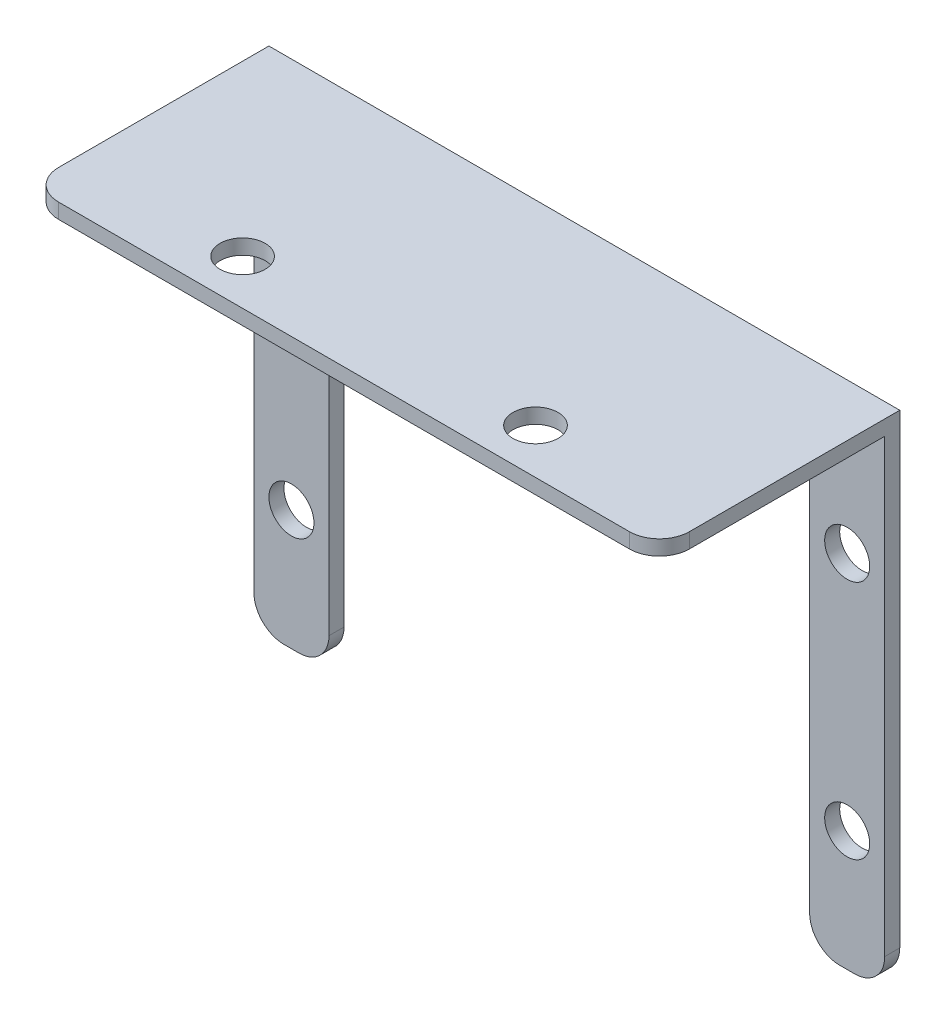
ISO-10303-21;
HEADER;
FILE_DESCRIPTION(('STEP AP214'),'2;1');
FILE_NAME('part.step','',(''),(''),'','','');
FILE_SCHEMA(('AUTOMOTIVE_DESIGN { 1 0 10303 214 1 1 1 1 }'));
ENDSEC;
DATA;
#1=APPLICATION_CONTEXT('core data for automotive mechanical design processes');
#2=APPLICATION_PROTOCOL_DEFINITION('international standard','automotive_design',2000,#1);
#3=PRODUCT_CONTEXT('',#1,'mechanical');
#4=PRODUCT('Part','Part','',(#3));
#5=PRODUCT_RELATED_PRODUCT_CATEGORY('part','',(#4));
#6=PRODUCT_DEFINITION_FORMATION('','',#4);
#7=PRODUCT_DEFINITION_CONTEXT('part definition',#1,'design');
#8=PRODUCT_DEFINITION('design','',#6,#7);
#9=PRODUCT_DEFINITION_SHAPE('','',#8);
#10=(LENGTH_UNIT() NAMED_UNIT(*) SI_UNIT(.MILLI.,.METRE.));
#11=(NAMED_UNIT(*) PLANE_ANGLE_UNIT() SI_UNIT($,.RADIAN.));
#12=(NAMED_UNIT(*) SI_UNIT($,.STERADIAN.) SOLID_ANGLE_UNIT());
#13=UNCERTAINTY_MEASURE_WITH_UNIT(LENGTH_MEASURE(1.E-05),#10,'distance_accuracy_value','');
#14=(GEOMETRIC_REPRESENTATION_CONTEXT(3) GLOBAL_UNCERTAINTY_ASSIGNED_CONTEXT((#13)) GLOBAL_UNIT_ASSIGNED_CONTEXT((#10,
#11,#12)) REPRESENTATION_CONTEXT('',''));
#15=CARTESIAN_POINT('',(0.,0.,0.));
#16=DIRECTION('',(0.,0.,1.));
#17=DIRECTION('',(1.,0.,0.));
#18=AXIS2_PLACEMENT_3D('',#15,#16,#17);
#19=CARTESIAN_POINT('',(0.,0.,0.));
#20=DIRECTION('',(0.,1.,0.));
#21=DIRECTION('',(0.,0.,1.));
#22=AXIS2_PLACEMENT_3D('',#19,#20,#21);
#23=PLANE('',#22);
#24=CARTESIAN_POINT('',(11.25,0.,13.));
#25=DIRECTION('',(0.,1.,0.));
#26=DIRECTION('',(0.,0.,1.));
#27=AXIS2_PLACEMENT_3D('',#24,#25,#26);
#28=CIRCLE('',#27,1.5);
#29=CARTESIAN_POINT('',(11.25,0.,14.5));
#30=VERTEX_POINT('',#29);
#31=EDGE_CURVE('E405',#30,#30,#28,.F.);
#32=ORIENTED_EDGE('',*,*,#31,.F.);
#33=EDGE_LOOP('',(#32));
#34=FACE_BOUND('',#33,.T.);
#35=CARTESIAN_POINT('',(30.75,0.,13.));
#36=DIRECTION('',(0.,1.,0.));
#37=DIRECTION('',(0.,0.,1.));
#38=AXIS2_PLACEMENT_3D('',#35,#36,#37);
#39=CIRCLE('',#38,1.5);
#40=CARTESIAN_POINT('',(30.75,0.,14.5));
#41=VERTEX_POINT('',#40);
#42=EDGE_CURVE('E411',#41,#41,#39,.F.);
#43=ORIENTED_EDGE('',*,*,#42,.F.);
#44=EDGE_LOOP('',(#43));
#45=FACE_BOUND('',#44,.T.);
#46=DIRECTION('',(0.,0.,1.));
#47=VECTOR('',#46,1.);
#48=CARTESIAN_POINT('',(42.,0.,0.));
#49=LINE('',#48,#47);
#50=CARTESIAN_POINT('',(42.,0.,0.999999999999976));
#51=VERTEX_POINT('',#50);
#52=CARTESIAN_POINT('',(42.,0.,14.));
#53=VERTEX_POINT('',#52);
#54=EDGE_CURVE('E171',#51,#53,#49,.T.);
#55=ORIENTED_EDGE('',*,*,#54,.T.);
#56=CARTESIAN_POINT('',(40.,0.,14.));
#57=DIRECTION('',(0.,1.,0.));
#58=DIRECTION('',(0.,0.,1.));
#59=AXIS2_PLACEMENT_3D('',#56,#57,#58);
#60=CIRCLE('',#59,2.);
#61=CARTESIAN_POINT('',(40.,0.,16.));
#62=VERTEX_POINT('',#61);
#63=EDGE_CURVE('E270',#53,#62,#60,.F.);
#64=ORIENTED_EDGE('',*,*,#63,.T.);
#65=DIRECTION('',(1.,0.,0.));
#66=VECTOR('',#65,1.);
#67=CARTESIAN_POINT('',(0.,0.,16.));
#68=LINE('',#67,#66);
#69=CARTESIAN_POINT('',(2.,0.,16.));
#70=VERTEX_POINT('',#69);
#71=EDGE_CURVE('E220',#70,#62,#68,.T.);
#72=ORIENTED_EDGE('',*,*,#71,.F.);
#73=CARTESIAN_POINT('',(2.,0.,14.));
#74=DIRECTION('',(0.,1.,0.));
#75=DIRECTION('',(0.,0.,1.));
#76=AXIS2_PLACEMENT_3D('',#73,#74,#75);
#77=CIRCLE('',#76,2.);
#78=CARTESIAN_POINT('',(0.,0.,14.));
#79=VERTEX_POINT('',#78);
#80=EDGE_CURVE('E268',#70,#79,#77,.F.);
#81=ORIENTED_EDGE('',*,*,#80,.T.);
#82=DIRECTION('',(0.,0.,1.));
#83=VECTOR('',#82,1.);
#84=CARTESIAN_POINT('',(0.,0.,0.));
#85=LINE('',#84,#83);
#86=CARTESIAN_POINT('',(0.,0.,1.));
#87=VERTEX_POINT('',#86);
#88=EDGE_CURVE('E207',#87,#79,#85,.T.);
#89=ORIENTED_EDGE('',*,*,#88,.F.);
#90=DIRECTION('',(-1.,0.,0.));
#91=VECTOR('',#90,1.);
#92=CARTESIAN_POINT('',(0.,0.,1.));
#93=LINE('',#92,#91);
#94=CARTESIAN_POINT('',(5.,0.,1.));
#95=VERTEX_POINT('',#94);
#96=EDGE_CURVE('E177',#95,#87,#93,.T.);
#97=ORIENTED_EDGE('',*,*,#96,.F.);
#98=DIRECTION('',(0.,0.,1.));
#99=VECTOR('',#98,1.);
#100=CARTESIAN_POINT('',(5.,0.,0.));
#101=LINE('',#100,#99);
#102=CARTESIAN_POINT('',(5.,0.,0.));
#103=VERTEX_POINT('',#102);
#104=EDGE_CURVE('E154',#103,#95,#101,.T.);
#105=ORIENTED_EDGE('',*,*,#104,.F.);
#106=DIRECTION('',(1.,0.,0.));
#107=VECTOR('',#106,1.);
#108=CARTESIAN_POINT('',(0.,0.,0.));
#109=LINE('',#108,#107);
#110=CARTESIAN_POINT('',(37.,0.,0.));
#111=VERTEX_POINT('',#110);
#112=EDGE_CURVE('E163',#103,#111,#109,.T.);
#113=ORIENTED_EDGE('',*,*,#112,.T.);
#114=DIRECTION('',(0.,0.,-1.));
#115=VECTOR('',#114,1.);
#116=CARTESIAN_POINT('',(37.,0.,0.));
#117=LINE('',#116,#115);
#118=CARTESIAN_POINT('',(37.,0.,0.999999999999979));
#119=VERTEX_POINT('',#118);
#120=EDGE_CURVE('E196',#119,#111,#117,.T.);
#121=ORIENTED_EDGE('',*,*,#120,.F.);
#122=DIRECTION('',(-1.,0.,0.));
#123=VECTOR('',#122,1.);
#124=CARTESIAN_POINT('',(42.,0.,0.999999999999973));
#125=LINE('',#124,#123);
#126=EDGE_CURVE('E191',#51,#119,#125,.T.);
#127=ORIENTED_EDGE('',*,*,#126,.F.);
#128=EDGE_LOOP('',(#55,#64,#72,#81,#89,#97,#105,#113,#121,#127));
#129=FACE_BOUND('',#128,.T.);
#130=ADVANCED_FACE('F36',(#34,#45,#129),#23,.F.);
#131=CARTESIAN_POINT('',(0.,1.,0.));
#132=DIRECTION('',(1.,0.,0.));
#133=DIRECTION('',(0.,0.,-1.));
#134=AXIS2_PLACEMENT_3D('',#131,#132,#133);
#135=PLANE('',#134);
#136=DIRECTION('',(0.,-1.,0.));
#137=VECTOR('',#136,1.);
#138=CARTESIAN_POINT('',(0.,1.,0.));
#139=LINE('',#138,#137);
#140=CARTESIAN_POINT('',(0.,1.,0.));
#141=VERTEX_POINT('',#140);
#142=CARTESIAN_POINT('',(0.,-30.,0.));
#143=VERTEX_POINT('',#142);
#144=EDGE_CURVE('E217',#141,#143,#139,.T.);
#145=ORIENTED_EDGE('',*,*,#144,.T.);
#146=DIRECTION('',(0.,0.,-1.));
#147=VECTOR('',#146,1.);
#148=CARTESIAN_POINT('',(0.,-30.,0.));
#149=LINE('',#148,#147);
#150=CARTESIAN_POINT('',(0.,-30.,1.));
#151=VERTEX_POINT('',#150);
#152=EDGE_CURVE('E249',#143,#151,#149,.F.);
#153=ORIENTED_EDGE('',*,*,#152,.T.);
#154=DIRECTION('',(0.,1.,0.));
#155=VECTOR('',#154,1.);
#156=CARTESIAN_POINT('',(0.,-32.,1.));
#157=LINE('',#156,#155);
#158=EDGE_CURVE('E159',#151,#87,#157,.T.);
#159=ORIENTED_EDGE('',*,*,#158,.T.);
#160=ORIENTED_EDGE('',*,*,#88,.T.);
#161=DIRECTION('',(0.,-1.,0.));
#162=VECTOR('',#161,1.);
#163=CARTESIAN_POINT('',(0.,1.,14.));
#164=LINE('',#163,#162);
#165=CARTESIAN_POINT('',(0.,1.,14.));
#166=VERTEX_POINT('',#165);
#167=EDGE_CURVE('E247',#79,#166,#164,.F.);
#168=ORIENTED_EDGE('',*,*,#167,.T.);
#169=DIRECTION('',(0.,0.,1.));
#170=VECTOR('',#169,1.);
#171=CARTESIAN_POINT('',(0.,1.,0.));
#172=LINE('',#171,#170);
#173=EDGE_CURVE('E170',#141,#166,#172,.T.);
#174=ORIENTED_EDGE('',*,*,#173,.F.);
#175=EDGE_LOOP('',(#145,#153,#159,#160,#168,#174));
#176=FACE_BOUND('',#175,.T.);
#177=ADVANCED_FACE('F296',(#176),#135,.F.);
#178=CARTESIAN_POINT('',(0.,1.,16.));
#179=DIRECTION('',(0.,0.,-1.));
#180=DIRECTION('',(-1.,0.,0.));
#181=AXIS2_PLACEMENT_3D('',#178,#179,#180);
#182=PLANE('',#181);
#183=ORIENTED_EDGE('',*,*,#71,.T.);
#184=DIRECTION('',(0.,-1.,0.));
#185=VECTOR('',#184,1.);
#186=CARTESIAN_POINT('',(40.,1.,16.));
#187=LINE('',#186,#185);
#188=CARTESIAN_POINT('',(40.,1.,16.));
#189=VERTEX_POINT('',#188);
#190=EDGE_CURVE('E51',#62,#189,#187,.F.);
#191=ORIENTED_EDGE('',*,*,#190,.T.);
#192=DIRECTION('',(1.,0.,0.));
#193=VECTOR('',#192,1.);
#194=CARTESIAN_POINT('',(0.,1.,16.));
#195=LINE('',#194,#193);
#196=CARTESIAN_POINT('',(2.,1.,16.));
#197=VERTEX_POINT('',#196);
#198=EDGE_CURVE('E209',#197,#189,#195,.T.);
#199=ORIENTED_EDGE('',*,*,#198,.F.);
#200=DIRECTION('',(0.,-1.,0.));
#201=VECTOR('',#200,1.);
#202=CARTESIAN_POINT('',(2.,1.,16.));
#203=LINE('',#202,#201);
#204=EDGE_CURVE('E272',#197,#70,#203,.T.);
#205=ORIENTED_EDGE('',*,*,#204,.T.);
#206=EDGE_LOOP('',(#183,#191,#199,#205));
#207=FACE_BOUND('',#206,.T.);
#208=ADVANCED_FACE('F277',(#207),#182,.F.);
#209=CARTESIAN_POINT('',(42.,1.,0.));
#210=DIRECTION('',(1.,0.,0.));
#211=DIRECTION('',(0.,0.,-1.));
#212=AXIS2_PLACEMENT_3D('',#209,#210,#211);
#213=PLANE('',#212);
#214=DIRECTION('',(0.,1.,0.));
#215=VECTOR('',#214,1.);
#216=CARTESIAN_POINT('',(42.,-32.,0.999999999999973));
#217=LINE('',#216,#215);
#218=CARTESIAN_POINT('',(42.,-30.,0.999999999999973));
#219=VERTEX_POINT('',#218);
#220=EDGE_CURVE('E205',#219,#51,#217,.T.);
#221=ORIENTED_EDGE('',*,*,#220,.F.);
#222=DIRECTION('',(0.,0.,1.));
#223=VECTOR('',#222,1.);
#224=CARTESIAN_POINT('',(42.,-30.,0.));
#225=LINE('',#224,#223);
#226=CARTESIAN_POINT('',(42.,-30.,0.));
#227=VERTEX_POINT('',#226);
#228=EDGE_CURVE('E266',#219,#227,#225,.F.);
#229=ORIENTED_EDGE('',*,*,#228,.T.);
#230=DIRECTION('',(0.,-1.,0.));
#231=VECTOR('',#230,1.);
#232=CARTESIAN_POINT('',(42.,1.,0.));
#233=LINE('',#232,#231);
#234=CARTESIAN_POINT('',(42.,1.,0.));
#235=VERTEX_POINT('',#234);
#236=EDGE_CURVE('E225',#235,#227,#233,.T.);
#237=ORIENTED_EDGE('',*,*,#236,.F.);
#238=DIRECTION('',(0.,0.,1.));
#239=VECTOR('',#238,1.);
#240=CARTESIAN_POINT('',(42.,1.,0.));
#241=LINE('',#240,#239);
#242=CARTESIAN_POINT('',(42.,1.,14.));
#243=VERTEX_POINT('',#242);
#244=EDGE_CURVE('E211',#235,#243,#241,.T.);
#245=ORIENTED_EDGE('',*,*,#244,.T.);
#246=DIRECTION('',(0.,-1.,0.));
#247=VECTOR('',#246,1.);
#248=CARTESIAN_POINT('',(42.,0.,14.));
#249=LINE('',#248,#247);
#250=EDGE_CURVE('E263',#243,#53,#249,.T.);
#251=ORIENTED_EDGE('',*,*,#250,.T.);
#252=ORIENTED_EDGE('',*,*,#54,.F.);
#253=EDGE_LOOP('',(#221,#229,#237,#245,#251,#252));
#254=FACE_BOUND('',#253,.T.);
#255=ADVANCED_FACE('F287',(#254),#213,.T.);
#256=CARTESIAN_POINT('',(0.,1.,0.));
#257=DIRECTION('',(0.,0.,-1.));
#258=DIRECTION('',(-1.,0.,0.));
#259=AXIS2_PLACEMENT_3D('',#256,#257,#258);
#260=PLANE('',#259);
#261=CARTESIAN_POINT('',(2.49999999999988,-7.99999999999974,0.));
#262=DIRECTION('',(0.,0.,-1.));
#263=DIRECTION('',(1.,0.,0.));
#264=AXIS2_PLACEMENT_3D('',#261,#262,#263);
#265=CIRCLE('',#264,1.5);
#266=CARTESIAN_POINT('',(3.99999999999988,-7.99999999999974,0.));
#267=VERTEX_POINT('',#266);
#268=EDGE_CURVE('E406',#267,#267,#265,.T.);
#269=ORIENTED_EDGE('',*,*,#268,.F.);
#270=EDGE_LOOP('',(#269));
#271=FACE_BOUND('',#270,.T.);
#272=CARTESIAN_POINT('',(2.49999999999966,-23.9999999999997,0.));
#273=DIRECTION('',(0.,0.,-1.));
#274=DIRECTION('',(1.,0.,0.));
#275=AXIS2_PLACEMENT_3D('',#272,#273,#274);
#276=CIRCLE('',#275,1.5);
#277=CARTESIAN_POINT('',(3.99999999999966,-23.9999999999997,0.));
#278=VERTEX_POINT('',#277);
#279=EDGE_CURVE('E426',#278,#278,#276,.T.);
#280=ORIENTED_EDGE('',*,*,#279,.F.);
#281=EDGE_LOOP('',(#280));
#282=FACE_BOUND('',#281,.T.);
#283=CARTESIAN_POINT('',(39.5,-24.,0.));
#284=DIRECTION('',(0.,0.,-1.));
#285=DIRECTION('',(-1.,0.,0.));
#286=AXIS2_PLACEMENT_3D('',#283,#284,#285);
#287=CIRCLE('',#286,1.5);
#288=CARTESIAN_POINT('',(38.,-24.,0.));
#289=VERTEX_POINT('',#288);
#290=EDGE_CURVE('E419',#289,#289,#287,.T.);
#291=ORIENTED_EDGE('',*,*,#290,.F.);
#292=EDGE_LOOP('',(#291));
#293=FACE_BOUND('',#292,.T.);
#294=CARTESIAN_POINT('',(39.5,-8.,0.));
#295=DIRECTION('',(0.,0.,-1.));
#296=DIRECTION('',(-1.,0.,0.));
#297=AXIS2_PLACEMENT_3D('',#294,#295,#296);
#298=CIRCLE('',#297,1.5);
#299=CARTESIAN_POINT('',(38.,-8.,0.));
#300=VERTEX_POINT('',#299);
#301=EDGE_CURVE('E183',#300,#300,#298,.T.);
#302=ORIENTED_EDGE('',*,*,#301,.F.);
#303=EDGE_LOOP('',(#302));
#304=FACE_BOUND('',#303,.T.);
#305=DIRECTION('',(0.,1.,0.));
#306=VECTOR('',#305,1.);
#307=CARTESIAN_POINT('',(5.,-32.,0.));
#308=LINE('',#307,#306);
#309=CARTESIAN_POINT('',(5.,-30.,0.));
#310=VERTEX_POINT('',#309);
#311=EDGE_CURVE('E149',#310,#103,#308,.T.);
#312=ORIENTED_EDGE('',*,*,#311,.F.);
#313=CARTESIAN_POINT('',(3.,-30.,0.));
#314=DIRECTION('',(0.,0.,-1.));
#315=DIRECTION('',(-1.,0.,0.));
#316=AXIS2_PLACEMENT_3D('',#313,#314,#315);
#317=CIRCLE('',#316,2.);
#318=CARTESIAN_POINT('',(3.,-32.,0.));
#319=VERTEX_POINT('',#318);
#320=EDGE_CURVE('E245',#310,#319,#317,.T.);
#321=ORIENTED_EDGE('',*,*,#320,.T.);
#322=DIRECTION('',(1.,0.,0.));
#323=VECTOR('',#322,1.);
#324=CARTESIAN_POINT('',(0.,-32.,0.));
#325=LINE('',#324,#323);
#326=CARTESIAN_POINT('',(2.,-32.,0.));
#327=VERTEX_POINT('',#326);
#328=EDGE_CURVE('E160',#327,#319,#325,.T.);
#329=ORIENTED_EDGE('',*,*,#328,.F.);
#330=CARTESIAN_POINT('',(2.,-30.,0.));
#331=DIRECTION('',(0.,0.,-1.));
#332=DIRECTION('',(-1.,0.,0.));
#333=AXIS2_PLACEMENT_3D('',#330,#331,#332);
#334=CIRCLE('',#333,2.);
#335=EDGE_CURVE('E243',#327,#143,#334,.T.);
#336=ORIENTED_EDGE('',*,*,#335,.T.);
#337=ORIENTED_EDGE('',*,*,#144,.F.);
#338=DIRECTION('',(1.,0.,0.));
#339=VECTOR('',#338,1.);
#340=CARTESIAN_POINT('',(0.,1.,0.));
#341=LINE('',#340,#339);
#342=EDGE_CURVE('E214',#141,#235,#341,.T.);
#343=ORIENTED_EDGE('',*,*,#342,.T.);
#344=ORIENTED_EDGE('',*,*,#236,.T.);
#345=CARTESIAN_POINT('',(40.,-30.,0.));
#346=DIRECTION('',(0.,0.,-1.));
#347=DIRECTION('',(-1.,0.,0.));
#348=AXIS2_PLACEMENT_3D('',#345,#346,#347);
#349=CIRCLE('',#348,2.);
#350=CARTESIAN_POINT('',(40.,-32.,0.));
#351=VERTEX_POINT('',#350);
#352=EDGE_CURVE('E239',#227,#351,#349,.T.);
#353=ORIENTED_EDGE('',*,*,#352,.T.);
#354=DIRECTION('',(1.,0.,0.));
#355=VECTOR('',#354,1.);
#356=CARTESIAN_POINT('',(42.,-32.,0.));
#357=LINE('',#356,#355);
#358=CARTESIAN_POINT('',(39.,-32.,0.));
#359=VERTEX_POINT('',#358);
#360=EDGE_CURVE('E192',#359,#351,#357,.T.);
#361=ORIENTED_EDGE('',*,*,#360,.F.);
#362=CARTESIAN_POINT('',(39.,-30.,0.));
#363=DIRECTION('',(0.,0.,-1.));
#364=DIRECTION('',(-1.,0.,0.));
#365=AXIS2_PLACEMENT_3D('',#362,#363,#364);
#366=CIRCLE('',#365,2.);
#367=CARTESIAN_POINT('',(37.,-30.,0.));
#368=VERTEX_POINT('',#367);
#369=EDGE_CURVE('E241',#359,#368,#366,.T.);
#370=ORIENTED_EDGE('',*,*,#369,.T.);
#371=DIRECTION('',(0.,1.,0.));
#372=VECTOR('',#371,1.);
#373=CARTESIAN_POINT('',(37.,-32.,0.));
#374=LINE('',#373,#372);
#375=EDGE_CURVE('E166',#368,#111,#374,.T.);
#376=ORIENTED_EDGE('',*,*,#375,.T.);
#377=ORIENTED_EDGE('',*,*,#112,.F.);
#378=EDGE_LOOP('',(#312,#321,#329,#336,#337,#343,#344,#353,#361,#370,#376,#377));
#379=FACE_BOUND('',#378,.T.);
#380=ADVANCED_FACE('F164',(#271,#282,#293,#304,#379),#260,.T.);
#381=CARTESIAN_POINT('',(0.,1.,0.));
#382=DIRECTION('',(0.,1.,0.));
#383=DIRECTION('',(0.,0.,1.));
#384=AXIS2_PLACEMENT_3D('',#381,#382,#383);
#385=PLANE('',#384);
#386=CARTESIAN_POINT('',(11.25,1.,13.));
#387=DIRECTION('',(0.,1.,0.));
#388=DIRECTION('',(0.,0.,-1.));
#389=AXIS2_PLACEMENT_3D('',#386,#387,#388);
#390=CIRCLE('',#389,1.5);
#391=CARTESIAN_POINT('',(11.25,1.,11.5));
#392=VERTEX_POINT('',#391);
#393=EDGE_CURVE('E403',#392,#392,#390,.T.);
#394=ORIENTED_EDGE('',*,*,#393,.F.);
#395=EDGE_LOOP('',(#394));
#396=FACE_BOUND('',#395,.T.);
#397=CARTESIAN_POINT('',(30.75,1.,13.));
#398=DIRECTION('',(0.,1.,0.));
#399=DIRECTION('',(0.,0.,1.));
#400=AXIS2_PLACEMENT_3D('',#397,#398,#399);
#401=CIRCLE('',#400,1.5);
#402=CARTESIAN_POINT('',(30.75,1.,14.5));
#403=VERTEX_POINT('',#402);
#404=EDGE_CURVE('E414',#403,#403,#401,.T.);
#405=ORIENTED_EDGE('',*,*,#404,.F.);
#406=EDGE_LOOP('',(#405));
#407=FACE_BOUND('',#406,.T.);
#408=ORIENTED_EDGE('',*,*,#198,.T.);
#409=CARTESIAN_POINT('',(40.,1.,14.));
#410=DIRECTION('',(0.,1.,0.));
#411=DIRECTION('',(0.,0.,1.));
#412=AXIS2_PLACEMENT_3D('',#409,#410,#411);
#413=CIRCLE('',#412,2.);
#414=EDGE_CURVE('E11',#189,#243,#413,.T.);
#415=ORIENTED_EDGE('',*,*,#414,.T.);
#416=ORIENTED_EDGE('',*,*,#244,.F.);
#417=ORIENTED_EDGE('',*,*,#342,.F.);
#418=ORIENTED_EDGE('',*,*,#173,.T.);
#419=CARTESIAN_POINT('',(2.,1.,14.));
#420=DIRECTION('',(0.,1.,0.));
#421=DIRECTION('',(0.,0.,1.));
#422=AXIS2_PLACEMENT_3D('',#419,#420,#421);
#423=CIRCLE('',#422,2.);
#424=EDGE_CURVE('E44',#166,#197,#423,.T.);
#425=ORIENTED_EDGE('',*,*,#424,.T.);
#426=EDGE_LOOP('',(#408,#415,#416,#417,#418,#425));
#427=FACE_BOUND('',#426,.T.);
#428=ADVANCED_FACE('F290',(#396,#407,#427),#385,.T.);
#429=CARTESIAN_POINT('',(42.,-32.,0.999999999999973));
#430=DIRECTION('',(0.,0.,-1.));
#431=DIRECTION('',(-1.,0.,0.));
#432=AXIS2_PLACEMENT_3D('',#429,#430,#431);
#433=PLANE('',#432);
#434=CARTESIAN_POINT('',(39.5,-24.,0.999999999999977));
#435=DIRECTION('',(0.,0.,-1.));
#436=DIRECTION('',(-1.,0.,0.));
#437=AXIS2_PLACEMENT_3D('',#434,#435,#436);
#438=CIRCLE('',#437,1.5);
#439=CARTESIAN_POINT('',(38.,-24.,0.999999999999979));
#440=VERTEX_POINT('',#439);
#441=EDGE_CURVE('E422',#440,#440,#438,.F.);
#442=ORIENTED_EDGE('',*,*,#441,.F.);
#443=EDGE_LOOP('',(#442));
#444=FACE_BOUND('',#443,.T.);
#445=CARTESIAN_POINT('',(39.5,-8.,0.999999999999977));
#446=DIRECTION('',(0.,0.,-1.));
#447=DIRECTION('',(-1.,0.,0.));
#448=AXIS2_PLACEMENT_3D('',#445,#446,#447);
#449=CIRCLE('',#448,1.5);
#450=CARTESIAN_POINT('',(38.,-8.,0.999999999999979));
#451=VERTEX_POINT('',#450);
#452=EDGE_CURVE('E178',#451,#451,#449,.F.);
#453=ORIENTED_EDGE('',*,*,#452,.F.);
#454=EDGE_LOOP('',(#453));
#455=FACE_BOUND('',#454,.T.);
#456=DIRECTION('',(0.,1.,0.));
#457=VECTOR('',#456,1.);
#458=CARTESIAN_POINT('',(37.,-32.,0.999999999999979));
#459=LINE('',#458,#457);
#460=CARTESIAN_POINT('',(37.,-30.,0.999999999999979));
#461=VERTEX_POINT('',#460);
#462=EDGE_CURVE('E203',#461,#119,#459,.T.);
#463=ORIENTED_EDGE('',*,*,#462,.F.);
#464=CARTESIAN_POINT('',(39.,-30.,0.999999999999977));
#465=DIRECTION('',(0.,0.,-1.));
#466=DIRECTION('',(-1.,0.,0.));
#467=AXIS2_PLACEMENT_3D('',#464,#465,#466);
#468=CIRCLE('',#467,2.);
#469=CARTESIAN_POINT('',(39.,-32.,0.999999999999977));
#470=VERTEX_POINT('',#469);
#471=EDGE_CURVE('E261',#461,#470,#468,.F.);
#472=ORIENTED_EDGE('',*,*,#471,.T.);
#473=DIRECTION('',(-1.,0.,0.));
#474=VECTOR('',#473,1.);
#475=CARTESIAN_POINT('',(42.,-32.,0.999999999999973));
#476=LINE('',#475,#474);
#477=CARTESIAN_POINT('',(40.,-32.,0.999999999999975));
#478=VERTEX_POINT('',#477);
#479=EDGE_CURVE('E195',#478,#470,#476,.T.);
#480=ORIENTED_EDGE('',*,*,#479,.F.);
#481=CARTESIAN_POINT('',(40.,-30.,0.999999999999975));
#482=DIRECTION('',(0.,0.,-1.));
#483=DIRECTION('',(-1.,0.,0.));
#484=AXIS2_PLACEMENT_3D('',#481,#482,#483);
#485=CIRCLE('',#484,2.);
#486=EDGE_CURVE('E259',#478,#219,#485,.F.);
#487=ORIENTED_EDGE('',*,*,#486,.T.);
#488=ORIENTED_EDGE('',*,*,#220,.T.);
#489=ORIENTED_EDGE('',*,*,#126,.T.);
#490=EDGE_LOOP('',(#463,#472,#480,#487,#488,#489));
#491=FACE_BOUND('',#490,.T.);
#492=ADVANCED_FACE('F352',(#444,#455,#491),#433,.F.);
#493=CARTESIAN_POINT('',(37.,-32.,0.));
#494=DIRECTION('',(1.,0.,0.));
#495=DIRECTION('',(0.,0.,-1.));
#496=AXIS2_PLACEMENT_3D('',#493,#494,#495);
#497=PLANE('',#496);
#498=ORIENTED_EDGE('',*,*,#375,.F.);
#499=DIRECTION('',(0.,0.,-1.));
#500=VECTOR('',#499,1.);
#501=CARTESIAN_POINT('',(37.,-30.,0.));
#502=LINE('',#501,#500);
#503=EDGE_CURVE('E257',#368,#461,#502,.F.);
#504=ORIENTED_EDGE('',*,*,#503,.T.);
#505=ORIENTED_EDGE('',*,*,#462,.T.);
#506=ORIENTED_EDGE('',*,*,#120,.T.);
#507=EDGE_LOOP('',(#498,#504,#505,#506));
#508=FACE_BOUND('',#507,.T.);
#509=ADVANCED_FACE('F349',(#508),#497,.F.);
#510=CARTESIAN_POINT('',(0.,-32.,0.));
#511=DIRECTION('',(0.,1.,0.));
#512=DIRECTION('',(0.,0.,1.));
#513=AXIS2_PLACEMENT_3D('',#510,#511,#512);
#514=PLANE('',#513);
#515=ORIENTED_EDGE('',*,*,#479,.T.);
#516=DIRECTION('',(0.,0.,-1.));
#517=VECTOR('',#516,1.);
#518=CARTESIAN_POINT('',(39.,-32.,0.));
#519=LINE('',#518,#517);
#520=EDGE_CURVE('E254',#470,#359,#519,.T.);
#521=ORIENTED_EDGE('',*,*,#520,.T.);
#522=ORIENTED_EDGE('',*,*,#360,.T.);
#523=DIRECTION('',(0.,0.,1.));
#524=VECTOR('',#523,1.);
#525=CARTESIAN_POINT('',(40.,-32.,0.999999999999974));
#526=LINE('',#525,#524);
#527=EDGE_CURVE('E251',#351,#478,#526,.T.);
#528=ORIENTED_EDGE('',*,*,#527,.T.);
#529=EDGE_LOOP('',(#515,#521,#522,#528));
#530=FACE_BOUND('',#529,.T.);
#531=ADVANCED_FACE('F343',(#530),#514,.F.);
#532=CARTESIAN_POINT('',(5.,-32.,0.));
#533=DIRECTION('',(-1.,0.,0.));
#534=DIRECTION('',(0.,0.,1.));
#535=AXIS2_PLACEMENT_3D('',#532,#533,#534);
#536=PLANE('',#535);
#537=DIRECTION('',(0.,1.,0.));
#538=VECTOR('',#537,1.);
#539=CARTESIAN_POINT('',(5.,-32.,1.));
#540=LINE('',#539,#538);
#541=CARTESIAN_POINT('',(5.,-30.,1.));
#542=VERTEX_POINT('',#541);
#543=EDGE_CURVE('E189',#542,#95,#540,.T.);
#544=ORIENTED_EDGE('',*,*,#543,.F.);
#545=DIRECTION('',(0.,0.,1.));
#546=VECTOR('',#545,1.);
#547=CARTESIAN_POINT('',(5.,-30.,0.));
#548=LINE('',#547,#546);
#549=EDGE_CURVE('E156',#542,#310,#548,.F.);
#550=ORIENTED_EDGE('',*,*,#549,.T.);
#551=ORIENTED_EDGE('',*,*,#311,.T.);
#552=ORIENTED_EDGE('',*,*,#104,.T.);
#553=EDGE_LOOP('',(#544,#550,#551,#552));
#554=FACE_BOUND('',#553,.T.);
#555=ADVANCED_FACE('F152',(#554),#536,.F.);
#556=CARTESIAN_POINT('',(0.,-32.,1.));
#557=DIRECTION('',(0.,0.,-1.));
#558=DIRECTION('',(-1.,0.,0.));
#559=AXIS2_PLACEMENT_3D('',#556,#557,#558);
#560=PLANE('',#559);
#561=CARTESIAN_POINT('',(2.49999999999988,-7.99999999999974,1.));
#562=DIRECTION('',(0.,0.,-1.));
#563=DIRECTION('',(-1.,0.,0.));
#564=AXIS2_PLACEMENT_3D('',#561,#562,#563);
#565=CIRCLE('',#564,1.5);
#566=CARTESIAN_POINT('',(0.999999999999873,-7.99999999999974,1.));
#567=VERTEX_POINT('',#566);
#568=EDGE_CURVE('E409',#567,#567,#565,.F.);
#569=ORIENTED_EDGE('',*,*,#568,.F.);
#570=EDGE_LOOP('',(#569));
#571=FACE_BOUND('',#570,.T.);
#572=CARTESIAN_POINT('',(2.49999999999966,-23.9999999999997,1.));
#573=DIRECTION('',(0.,0.,-1.));
#574=DIRECTION('',(-1.,0.,0.));
#575=AXIS2_PLACEMENT_3D('',#572,#573,#574);
#576=CIRCLE('',#575,1.5);
#577=CARTESIAN_POINT('',(0.999999999999651,-23.9999999999997,1.));
#578=VERTEX_POINT('',#577);
#579=EDGE_CURVE('E423',#578,#578,#576,.F.);
#580=ORIENTED_EDGE('',*,*,#579,.F.);
#581=EDGE_LOOP('',(#580));
#582=FACE_BOUND('',#581,.T.);
#583=DIRECTION('',(-1.,0.,0.));
#584=VECTOR('',#583,1.);
#585=CARTESIAN_POINT('',(0.,-32.,1.));
#586=LINE('',#585,#584);
#587=CARTESIAN_POINT('',(3.,-32.,1.));
#588=VERTEX_POINT('',#587);
#589=CARTESIAN_POINT('',(2.,-32.,1.));
#590=VERTEX_POINT('',#589);
#591=EDGE_CURVE('E180',#588,#590,#586,.T.);
#592=ORIENTED_EDGE('',*,*,#591,.F.);
#593=CARTESIAN_POINT('',(3.,-30.,1.));
#594=DIRECTION('',(0.,0.,-1.));
#595=DIRECTION('',(-1.,0.,0.));
#596=AXIS2_PLACEMENT_3D('',#593,#594,#595);
#597=CIRCLE('',#596,2.);
#598=EDGE_CURVE('E236',#588,#542,#597,.F.);
#599=ORIENTED_EDGE('',*,*,#598,.T.);
#600=ORIENTED_EDGE('',*,*,#543,.T.);
#601=ORIENTED_EDGE('',*,*,#96,.T.);
#602=ORIENTED_EDGE('',*,*,#158,.F.);
#603=CARTESIAN_POINT('',(2.,-30.,1.));
#604=DIRECTION('',(0.,0.,-1.));
#605=DIRECTION('',(-1.,0.,0.));
#606=AXIS2_PLACEMENT_3D('',#603,#604,#605);
#607=CIRCLE('',#606,2.);
#608=EDGE_CURVE('E234',#151,#590,#607,.F.);
#609=ORIENTED_EDGE('',*,*,#608,.T.);
#610=EDGE_LOOP('',(#592,#599,#600,#601,#602,#609));
#611=FACE_BOUND('',#610,.T.);
#612=ADVANCED_FACE('F368',(#571,#582,#611),#560,.F.);
#613=CARTESIAN_POINT('',(0.,-32.,0.));
#614=DIRECTION('',(0.,1.,0.));
#615=DIRECTION('',(0.,0.,1.));
#616=AXIS2_PLACEMENT_3D('',#613,#614,#615);
#617=PLANE('',#616);
#618=ORIENTED_EDGE('',*,*,#328,.T.);
#619=DIRECTION('',(0.,0.,1.));
#620=VECTOR('',#619,1.);
#621=CARTESIAN_POINT('',(3.,-32.,0.));
#622=LINE('',#621,#620);
#623=EDGE_CURVE('E231',#319,#588,#622,.T.);
#624=ORIENTED_EDGE('',*,*,#623,.T.);
#625=ORIENTED_EDGE('',*,*,#591,.T.);
#626=DIRECTION('',(0.,0.,-1.));
#627=VECTOR('',#626,1.);
#628=CARTESIAN_POINT('',(2.,-32.,0.));
#629=LINE('',#628,#627);
#630=EDGE_CURVE('E228',#590,#327,#629,.T.);
#631=ORIENTED_EDGE('',*,*,#630,.T.);
#632=EDGE_LOOP('',(#618,#624,#625,#631));
#633=FACE_BOUND('',#632,.T.);
#634=ADVANCED_FACE('F371',(#633),#617,.F.);
#635=CARTESIAN_POINT('',(2.49999999999966,-23.9999999999997,16.001));
#636=DIRECTION('',(0.,0.,-1.));
#637=DIRECTION('',(-1.,0.,0.));
#638=AXIS2_PLACEMENT_3D('',#635,#636,#637);
#639=CYLINDRICAL_SURFACE('',#638,1.5);
#640=ORIENTED_EDGE('',*,*,#279,.T.);
#641=EDGE_LOOP('',(#640));
#642=FACE_BOUND('',#641,.T.);
#643=ORIENTED_EDGE('',*,*,#579,.T.);
#644=EDGE_LOOP('',(#643));
#645=FACE_BOUND('',#644,.T.);
#646=ADVANCED_FACE('F375',(#642,#645),#639,.F.);
#647=CARTESIAN_POINT('',(2.49999999999988,-7.99999999999974,16.001));
#648=DIRECTION('',(0.,0.,-1.));
#649=DIRECTION('',(-1.,0.,0.));
#650=AXIS2_PLACEMENT_3D('',#647,#648,#649);
#651=CYLINDRICAL_SURFACE('',#650,1.5);
#652=ORIENTED_EDGE('',*,*,#268,.T.);
#653=EDGE_LOOP('',(#652));
#654=FACE_BOUND('',#653,.T.);
#655=ORIENTED_EDGE('',*,*,#568,.T.);
#656=EDGE_LOOP('',(#655));
#657=FACE_BOUND('',#656,.T.);
#658=ADVANCED_FACE('F381',(#654,#657),#651,.F.);
#659=CARTESIAN_POINT('',(39.5,-8.,16.001));
#660=DIRECTION('',(0.,0.,-1.));
#661=DIRECTION('',(-1.,0.,0.));
#662=AXIS2_PLACEMENT_3D('',#659,#660,#661);
#663=CYLINDRICAL_SURFACE('',#662,1.5);
#664=ORIENTED_EDGE('',*,*,#301,.T.);
#665=EDGE_LOOP('',(#664));
#666=FACE_BOUND('',#665,.T.);
#667=ORIENTED_EDGE('',*,*,#452,.T.);
#668=EDGE_LOOP('',(#667));
#669=FACE_BOUND('',#668,.T.);
#670=ADVANCED_FACE('F377',(#666,#669),#663,.F.);
#671=CARTESIAN_POINT('',(39.5,-24.,16.001));
#672=DIRECTION('',(0.,0.,-1.));
#673=DIRECTION('',(-1.,0.,0.));
#674=AXIS2_PLACEMENT_3D('',#671,#672,#673);
#675=CYLINDRICAL_SURFACE('',#674,1.5);
#676=ORIENTED_EDGE('',*,*,#290,.T.);
#677=EDGE_LOOP('',(#676));
#678=FACE_BOUND('',#677,.T.);
#679=ORIENTED_EDGE('',*,*,#441,.T.);
#680=EDGE_LOOP('',(#679));
#681=FACE_BOUND('',#680,.T.);
#682=ADVANCED_FACE('F380',(#678,#681),#675,.F.);
#683=CARTESIAN_POINT('',(30.75,-32.001,13.));
#684=DIRECTION('',(0.,1.,0.));
#685=DIRECTION('',(0.,0.,1.));
#686=AXIS2_PLACEMENT_3D('',#683,#684,#685);
#687=CYLINDRICAL_SURFACE('',#686,1.5);
#688=ORIENTED_EDGE('',*,*,#404,.T.);
#689=EDGE_LOOP('',(#688));
#690=FACE_BOUND('',#689,.T.);
#691=ORIENTED_EDGE('',*,*,#42,.T.);
#692=EDGE_LOOP('',(#691));
#693=FACE_BOUND('',#692,.T.);
#694=ADVANCED_FACE('F391',(#690,#693),#687,.F.);
#695=CARTESIAN_POINT('',(11.25,-32.001,13.));
#696=DIRECTION('',(0.,1.,0.));
#697=DIRECTION('',(0.,0.,1.));
#698=AXIS2_PLACEMENT_3D('',#695,#696,#697);
#699=CYLINDRICAL_SURFACE('',#698,1.5);
#700=ORIENTED_EDGE('',*,*,#393,.T.);
#701=EDGE_LOOP('',(#700));
#702=FACE_BOUND('',#701,.T.);
#703=ORIENTED_EDGE('',*,*,#31,.T.);
#704=EDGE_LOOP('',(#703));
#705=FACE_BOUND('',#704,.T.);
#706=ADVANCED_FACE('F326',(#702,#705),#699,.F.);
#707=CARTESIAN_POINT('',(3.,-30.,0.));
#708=DIRECTION('',(0.,0.,1.));
#709=DIRECTION('',(1.,0.,0.));
#710=AXIS2_PLACEMENT_3D('',#707,#708,#709);
#711=CYLINDRICAL_SURFACE('',#710,2.);
#712=ORIENTED_EDGE('',*,*,#320,.F.);
#713=ORIENTED_EDGE('',*,*,#549,.F.);
#714=ORIENTED_EDGE('',*,*,#598,.F.);
#715=ORIENTED_EDGE('',*,*,#623,.F.);
#716=EDGE_LOOP('',(#712,#713,#714,#715));
#717=FACE_BOUND('',#716,.T.);
#718=ADVANCED_FACE('F322',(#717),#711,.T.);
#719=CARTESIAN_POINT('',(2.,-30.,0.));
#720=DIRECTION('',(0.,0.,-1.));
#721=DIRECTION('',(-1.,0.,0.));
#722=AXIS2_PLACEMENT_3D('',#719,#720,#721);
#723=CYLINDRICAL_SURFACE('',#722,2.);
#724=ORIENTED_EDGE('',*,*,#608,.F.);
#725=ORIENTED_EDGE('',*,*,#152,.F.);
#726=ORIENTED_EDGE('',*,*,#335,.F.);
#727=ORIENTED_EDGE('',*,*,#630,.F.);
#728=EDGE_LOOP('',(#724,#725,#726,#727));
#729=FACE_BOUND('',#728,.T.);
#730=ADVANCED_FACE('F325',(#729),#723,.T.);
#731=CARTESIAN_POINT('',(39.,-30.,0.));
#732=DIRECTION('',(0.,0.,-1.));
#733=DIRECTION('',(-1.,0.,0.));
#734=AXIS2_PLACEMENT_3D('',#731,#732,#733);
#735=CYLINDRICAL_SURFACE('',#734,2.);
#736=ORIENTED_EDGE('',*,*,#471,.F.);
#737=ORIENTED_EDGE('',*,*,#503,.F.);
#738=ORIENTED_EDGE('',*,*,#369,.F.);
#739=ORIENTED_EDGE('',*,*,#520,.F.);
#740=EDGE_LOOP('',(#736,#737,#738,#739));
#741=FACE_BOUND('',#740,.T.);
#742=ADVANCED_FACE('F330',(#741),#735,.T.);
#743=CARTESIAN_POINT('',(40.,-30.,0.));
#744=DIRECTION('',(0.,0.,-1.));
#745=DIRECTION('',(-1.,0.,0.));
#746=AXIS2_PLACEMENT_3D('',#743,#744,#745);
#747=CYLINDRICAL_SURFACE('',#746,2.);
#748=ORIENTED_EDGE('',*,*,#352,.F.);
#749=ORIENTED_EDGE('',*,*,#228,.F.);
#750=ORIENTED_EDGE('',*,*,#486,.F.);
#751=ORIENTED_EDGE('',*,*,#527,.F.);
#752=EDGE_LOOP('',(#748,#749,#750,#751));
#753=FACE_BOUND('',#752,.T.);
#754=ADVANCED_FACE('F302',(#753),#747,.T.);
#755=CARTESIAN_POINT('',(40.,1.,14.));
#756=DIRECTION('',(0.,1.,0.));
#757=DIRECTION('',(0.,0.,1.));
#758=AXIS2_PLACEMENT_3D('',#755,#756,#757);
#759=CYLINDRICAL_SURFACE('',#758,2.);
#760=ORIENTED_EDGE('',*,*,#414,.F.);
#761=ORIENTED_EDGE('',*,*,#190,.F.);
#762=ORIENTED_EDGE('',*,*,#63,.F.);
#763=ORIENTED_EDGE('',*,*,#250,.F.);
#764=EDGE_LOOP('',(#760,#761,#762,#763));
#765=FACE_BOUND('',#764,.T.);
#766=ADVANCED_FACE('F284',(#765),#759,.T.);
#767=CARTESIAN_POINT('',(2.,1.,14.));
#768=DIRECTION('',(0.,-1.,0.));
#769=DIRECTION('',(0.,0.,-1.));
#770=AXIS2_PLACEMENT_3D('',#767,#768,#769);
#771=CYLINDRICAL_SURFACE('',#770,2.);
#772=ORIENTED_EDGE('',*,*,#424,.F.);
#773=ORIENTED_EDGE('',*,*,#167,.F.);
#774=ORIENTED_EDGE('',*,*,#80,.F.);
#775=ORIENTED_EDGE('',*,*,#204,.F.);
#776=EDGE_LOOP('',(#772,#773,#774,#775));
#777=FACE_BOUND('',#776,.T.);
#778=ADVANCED_FACE('F38',(#777),#771,.T.);
#779=CLOSED_SHELL('',(#130,#177,#208,#255,#380,#428,#492,#509,#531,#555,#612,#634,#646,#658,
#670,#682,#694,#706,#718,#730,#742,#754,#766,#778));
#780=MANIFOLD_SOLID_BREP('B2',#779);
#781=ADVANCED_BREP_SHAPE_REPRESENTATION('',(#18,#780),#14);
#782=SHAPE_DEFINITION_REPRESENTATION(#9,#781);
ENDSEC;
END-ISO-10303-21;
